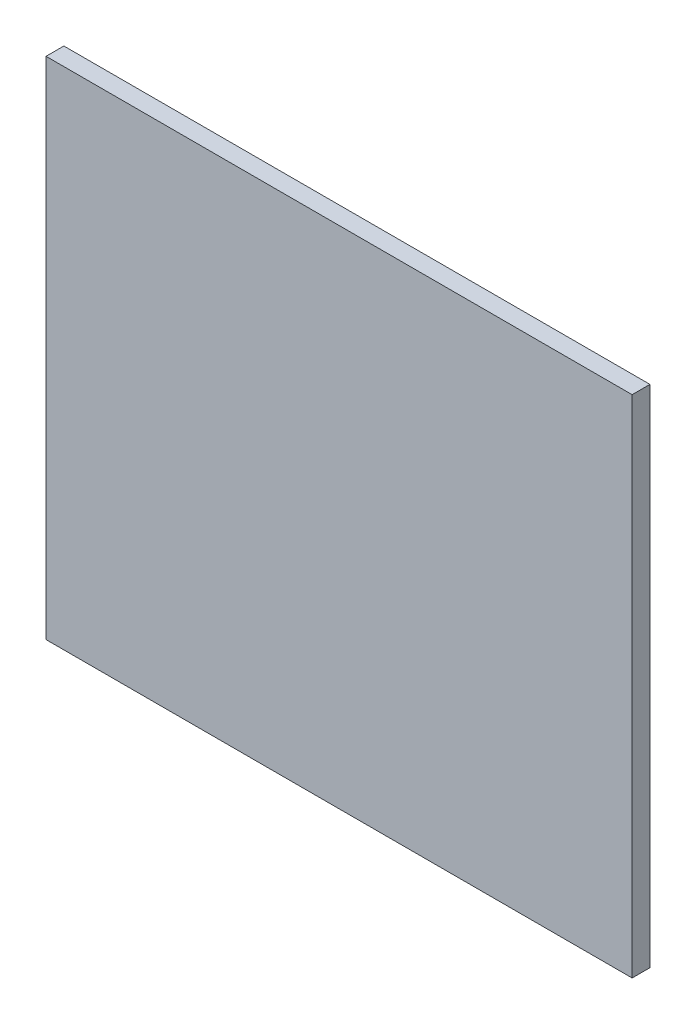
ISO-10303-21;
HEADER;
FILE_DESCRIPTION(('STEP AP214'),'2;1');
FILE_NAME('part.step','',(''),(''),'','','');
FILE_SCHEMA(('AUTOMOTIVE_DESIGN { 1 0 10303 214 1 1 1 1 }'));
ENDSEC;
DATA;
#1=APPLICATION_CONTEXT('core data for automotive mechanical design processes');
#2=APPLICATION_PROTOCOL_DEFINITION('international standard','automotive_design',2000,#1);
#3=PRODUCT_CONTEXT('',#1,'mechanical');
#4=PRODUCT('Part','Part','',(#3));
#5=PRODUCT_RELATED_PRODUCT_CATEGORY('part','',(#4));
#6=PRODUCT_DEFINITION_FORMATION('','',#4);
#7=PRODUCT_DEFINITION_CONTEXT('part definition',#1,'design');
#8=PRODUCT_DEFINITION('design','',#6,#7);
#9=PRODUCT_DEFINITION_SHAPE('','',#8);
#10=(LENGTH_UNIT() NAMED_UNIT(*) SI_UNIT(.MILLI.,.METRE.));
#11=(NAMED_UNIT(*) PLANE_ANGLE_UNIT() SI_UNIT($,.RADIAN.));
#12=(NAMED_UNIT(*) SI_UNIT($,.STERADIAN.) SOLID_ANGLE_UNIT());
#13=UNCERTAINTY_MEASURE_WITH_UNIT(LENGTH_MEASURE(1.E-05),#10,'distance_accuracy_value','');
#14=(GEOMETRIC_REPRESENTATION_CONTEXT(3) GLOBAL_UNCERTAINTY_ASSIGNED_CONTEXT((#13)) GLOBAL_UNIT_ASSIGNED_CONTEXT((#10,
#11,#12)) REPRESENTATION_CONTEXT('',''));
#15=CARTESIAN_POINT('',(0.,0.,0.));
#16=DIRECTION('',(0.,0.,1.));
#17=DIRECTION('',(1.,0.,0.));
#18=AXIS2_PLACEMENT_3D('',#15,#16,#17);
#19=CARTESIAN_POINT('',(-52.20625,-45.,3.175));
#20=DIRECTION('',(1.,0.,0.));
#21=DIRECTION('',(0.,1.,0.));
#22=AXIS2_PLACEMENT_3D('',#19,#20,#21);
#23=PLANE('',#22);
#24=DIRECTION('',(0.,-1.,0.));
#25=VECTOR('',#24,1.);
#26=CARTESIAN_POINT('',(-52.20625,-45.,0.));
#27=LINE('',#26,#25);
#28=CARTESIAN_POINT('',(-52.20625,45.,0.));
#29=VERTEX_POINT('',#28);
#30=CARTESIAN_POINT('',(-52.20625,-45.,0.));
#31=VERTEX_POINT('',#30);
#32=EDGE_CURVE('E98',#29,#31,#27,.T.);
#33=ORIENTED_EDGE('',*,*,#32,.T.);
#34=DIRECTION('',(0.,0.,-1.));
#35=VECTOR('',#34,1.);
#36=CARTESIAN_POINT('',(-52.20625,-45.,3.175));
#37=LINE('',#36,#35);
#38=CARTESIAN_POINT('',(-52.20625,-45.,3.175));
#39=VERTEX_POINT('',#38);
#40=EDGE_CURVE('E11',#39,#31,#37,.T.);
#41=ORIENTED_EDGE('',*,*,#40,.F.);
#42=DIRECTION('',(0.,-1.,0.));
#43=VECTOR('',#42,1.);
#44=CARTESIAN_POINT('',(-52.20625,-45.,3.175));
#45=LINE('',#44,#43);
#46=CARTESIAN_POINT('',(-52.20625,45.,3.175));
#47=VERTEX_POINT('',#46);
#48=EDGE_CURVE('E86',#47,#39,#45,.T.);
#49=ORIENTED_EDGE('',*,*,#48,.F.);
#50=DIRECTION('',(0.,0.,-1.));
#51=VECTOR('',#50,1.);
#52=CARTESIAN_POINT('',(-52.20625,45.,3.175));
#53=LINE('',#52,#51);
#54=EDGE_CURVE('E94',#47,#29,#53,.T.);
#55=ORIENTED_EDGE('',*,*,#54,.T.);
#56=EDGE_LOOP('',(#33,#41,#49,#55));
#57=FACE_BOUND('',#56,.T.);
#58=ADVANCED_FACE('F35',(#57),#23,.F.);
#59=CARTESIAN_POINT('',(-52.20625,-45.,3.175));
#60=DIRECTION('',(0.,1.,0.));
#61=DIRECTION('',(0.,0.,1.));
#62=AXIS2_PLACEMENT_3D('',#59,#60,#61);
#63=PLANE('',#62);
#64=DIRECTION('',(1.,0.,0.));
#65=VECTOR('',#64,1.);
#66=CARTESIAN_POINT('',(-52.20625,-45.,0.));
#67=LINE('',#66,#65);
#68=CARTESIAN_POINT('',(52.20625,-45.,0.));
#69=VERTEX_POINT('',#68);
#70=EDGE_CURVE('E90',#31,#69,#67,.T.);
#71=ORIENTED_EDGE('',*,*,#70,.T.);
#72=DIRECTION('',(0.,0.,-1.));
#73=VECTOR('',#72,1.);
#74=CARTESIAN_POINT('',(52.20625,-45.,3.175));
#75=LINE('',#74,#73);
#76=CARTESIAN_POINT('',(52.20625,-45.,3.175));
#77=VERTEX_POINT('',#76);
#78=EDGE_CURVE('E43',#77,#69,#75,.T.);
#79=ORIENTED_EDGE('',*,*,#78,.F.);
#80=DIRECTION('',(1.,0.,0.));
#81=VECTOR('',#80,1.);
#82=CARTESIAN_POINT('',(-52.20625,-45.,3.175));
#83=LINE('',#82,#81);
#84=EDGE_CURVE('E81',#39,#77,#83,.T.);
#85=ORIENTED_EDGE('',*,*,#84,.F.);
#86=ORIENTED_EDGE('',*,*,#40,.T.);
#87=EDGE_LOOP('',(#71,#79,#85,#86));
#88=FACE_BOUND('',#87,.T.);
#89=ADVANCED_FACE('F89',(#88),#63,.F.);
#90=CARTESIAN_POINT('',(52.20625,-45.,3.175));
#91=DIRECTION('',(-1.,0.,0.));
#92=DIRECTION('',(0.,-1.,0.));
#93=AXIS2_PLACEMENT_3D('',#90,#91,#92);
#94=PLANE('',#93);
#95=DIRECTION('',(0.,1.,0.));
#96=VECTOR('',#95,1.);
#97=CARTESIAN_POINT('',(52.20625,-45.,0.));
#98=LINE('',#97,#96);
#99=CARTESIAN_POINT('',(52.20625,45.,0.));
#100=VERTEX_POINT('',#99);
#101=EDGE_CURVE('E68',#69,#100,#98,.T.);
#102=ORIENTED_EDGE('',*,*,#101,.T.);
#103=DIRECTION('',(0.,0.,-1.));
#104=VECTOR('',#103,1.);
#105=CARTESIAN_POINT('',(52.20625,45.,3.175));
#106=LINE('',#105,#104);
#107=CARTESIAN_POINT('',(52.20625,45.,3.175));
#108=VERTEX_POINT('',#107);
#109=EDGE_CURVE('E91',#108,#100,#106,.T.);
#110=ORIENTED_EDGE('',*,*,#109,.F.);
#111=DIRECTION('',(0.,1.,0.));
#112=VECTOR('',#111,1.);
#113=CARTESIAN_POINT('',(52.20625,-45.,3.175));
#114=LINE('',#113,#112);
#115=EDGE_CURVE('E84',#77,#108,#114,.T.);
#116=ORIENTED_EDGE('',*,*,#115,.F.);
#117=ORIENTED_EDGE('',*,*,#78,.T.);
#118=EDGE_LOOP('',(#102,#110,#116,#117));
#119=FACE_BOUND('',#118,.T.);
#120=ADVANCED_FACE('F92',(#119),#94,.F.);
#121=CARTESIAN_POINT('',(-52.20625,45.,3.175));
#122=DIRECTION('',(0.,-1.,0.));
#123=DIRECTION('',(0.,0.,-1.));
#124=AXIS2_PLACEMENT_3D('',#121,#122,#123);
#125=PLANE('',#124);
#126=DIRECTION('',(-1.,0.,0.));
#127=VECTOR('',#126,1.);
#128=CARTESIAN_POINT('',(-52.20625,45.,0.));
#129=LINE('',#128,#127);
#130=EDGE_CURVE('E74',#100,#29,#129,.T.);
#131=ORIENTED_EDGE('',*,*,#130,.T.);
#132=ORIENTED_EDGE('',*,*,#54,.F.);
#133=DIRECTION('',(-1.,0.,0.));
#134=VECTOR('',#133,1.);
#135=CARTESIAN_POINT('',(-52.20625,45.,3.175));
#136=LINE('',#135,#134);
#137=EDGE_CURVE('E51',#108,#47,#136,.T.);
#138=ORIENTED_EDGE('',*,*,#137,.F.);
#139=ORIENTED_EDGE('',*,*,#109,.T.);
#140=EDGE_LOOP('',(#131,#132,#138,#139));
#141=FACE_BOUND('',#140,.T.);
#142=ADVANCED_FACE('F105',(#141),#125,.F.);
#143=CARTESIAN_POINT('',(0.,0.,3.175));
#144=DIRECTION('',(0.,0.,-1.));
#145=DIRECTION('',(-1.,0.,0.));
#146=AXIS2_PLACEMENT_3D('',#143,#144,#145);
#147=PLANE('',#146);
#148=ORIENTED_EDGE('',*,*,#48,.T.);
#149=ORIENTED_EDGE('',*,*,#84,.T.);
#150=ORIENTED_EDGE('',*,*,#115,.T.);
#151=ORIENTED_EDGE('',*,*,#137,.T.);
#152=EDGE_LOOP('',(#148,#149,#150,#151));
#153=FACE_BOUND('',#152,.T.);
#154=ADVANCED_FACE('F82',(#153),#147,.F.);
#155=CARTESIAN_POINT('',(0.,0.,0.));
#156=DIRECTION('',(0.,0.,-1.));
#157=DIRECTION('',(-1.,0.,0.));
#158=AXIS2_PLACEMENT_3D('',#155,#156,#157);
#159=PLANE('',#158);
#160=ORIENTED_EDGE('',*,*,#32,.F.);
#161=ORIENTED_EDGE('',*,*,#130,.F.);
#162=ORIENTED_EDGE('',*,*,#101,.F.);
#163=ORIENTED_EDGE('',*,*,#70,.F.);
#164=EDGE_LOOP('',(#160,#161,#162,#163));
#165=FACE_BOUND('',#164,.T.);
#166=ADVANCED_FACE('F108',(#165),#159,.T.);
#167=CLOSED_SHELL('',(#58,#89,#120,#142,#154,#166));
#168=MANIFOLD_SOLID_BREP('B2',#167);
#169=ADVANCED_BREP_SHAPE_REPRESENTATION('',(#18,#168),#14);
#170=SHAPE_DEFINITION_REPRESENTATION(#9,#169);
ENDSEC;
END-ISO-10303-21;
